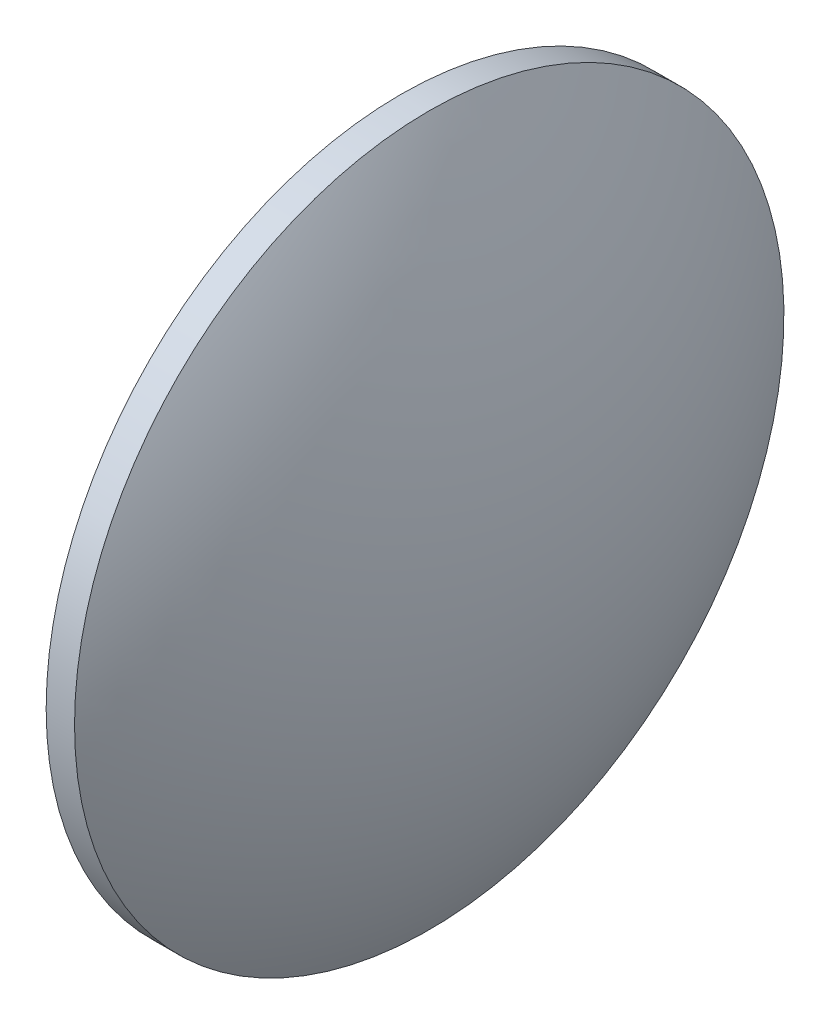
ISO-10303-21;
HEADER;
FILE_DESCRIPTION(('STEP AP214'),'2;1');
FILE_NAME('part.step','',(''),(''),'','','');
FILE_SCHEMA(('AUTOMOTIVE_DESIGN { 1 0 10303 214 1 1 1 1 }'));
ENDSEC;
DATA;
#1=APPLICATION_CONTEXT('core data for automotive mechanical design processes');
#2=APPLICATION_PROTOCOL_DEFINITION('international standard','automotive_design',2000,#1);
#3=PRODUCT_CONTEXT('',#1,'mechanical');
#4=PRODUCT('Part','Part','',(#3));
#5=PRODUCT_RELATED_PRODUCT_CATEGORY('part','',(#4));
#6=PRODUCT_DEFINITION_FORMATION('','',#4);
#7=PRODUCT_DEFINITION_CONTEXT('part definition',#1,'design');
#8=PRODUCT_DEFINITION('design','',#6,#7);
#9=PRODUCT_DEFINITION_SHAPE('','',#8);
#10=(LENGTH_UNIT() NAMED_UNIT(*) SI_UNIT(.MILLI.,.METRE.));
#11=(NAMED_UNIT(*) PLANE_ANGLE_UNIT() SI_UNIT($,.RADIAN.));
#12=(NAMED_UNIT(*) SI_UNIT($,.STERADIAN.) SOLID_ANGLE_UNIT());
#13=UNCERTAINTY_MEASURE_WITH_UNIT(LENGTH_MEASURE(1.E-05),#10,'distance_accuracy_value','');
#14=(GEOMETRIC_REPRESENTATION_CONTEXT(3) GLOBAL_UNCERTAINTY_ASSIGNED_CONTEXT((#13)) GLOBAL_UNIT_ASSIGNED_CONTEXT((#10,
#11,#12)) REPRESENTATION_CONTEXT('',''));
#15=CARTESIAN_POINT('',(0.,0.,0.));
#16=DIRECTION('',(0.,0.,1.));
#17=DIRECTION('',(1.,0.,0.));
#18=AXIS2_PLACEMENT_3D('',#15,#16,#17);
#19=CARTESIAN_POINT('',(422.349612919836,191.402019776316,0.));
#20=DIRECTION('',(-1.,0.,0.));
#21=DIRECTION('',(0.,1.,0.));
#22=AXIS2_PLACEMENT_3D('',#19,#20,#21);
#23=SPHERICAL_SURFACE('',#22,97.7230232558132);
#24=CARTESIAN_POINT('',(338.386589664023,191.402019776316,0.));
#25=DIRECTION('',(-1.,0.,0.));
#26=DIRECTION('',(0.,0.,1.));
#27=AXIS2_PLACEMENT_3D('',#24,#25,#26);
#28=CIRCLE('',#27,49.9999999999995);
#29=CARTESIAN_POINT('',(338.386589664023,191.402019776316,49.9999999999995));
#30=VERTEX_POINT('',#29);
#31=EDGE_CURVE('E46',#30,#30,#28,.T.);
#32=ORIENTED_EDGE('',*,*,#31,.T.);
#33=EDGE_LOOP('',(#32));
#34=FACE_BOUND('',#33,.T.);
#35=ADVANCED_FACE('F39',(#34),#23,.T.);
#36=CARTESIAN_POINT('',(258.42356640821,191.402019776316,0.));
#37=DIRECTION('',(-1.,0.,0.));
#38=DIRECTION('',(0.,1.,0.));
#39=AXIS2_PLACEMENT_3D('',#36,#37,#38);
#40=SPHERICAL_SURFACE('',#39,97.7230232558129);
#41=CARTESIAN_POINT('',(342.386589664023,191.402019776316,0.));
#42=DIRECTION('',(-1.,0.,0.));
#43=DIRECTION('',(0.,0.,1.));
#44=AXIS2_PLACEMENT_3D('',#41,#42,#43);
#45=CIRCLE('',#44,49.9999999999995);
#46=CARTESIAN_POINT('',(342.386589664023,191.402019776316,49.9999999999995));
#47=VERTEX_POINT('',#46);
#48=EDGE_CURVE('E10',#47,#47,#45,.T.);
#49=ORIENTED_EDGE('',*,*,#48,.F.);
#50=EDGE_LOOP('',(#49));
#51=FACE_BOUND('',#50,.T.);
#52=ADVANCED_FACE('F56',(#51),#40,.T.);
#53=CARTESIAN_POINT('',(315.881910424626,191.402019776316,0.));
#54=DIRECTION('',(-1.,0.,0.));
#55=DIRECTION('',(0.,0.,1.));
#56=AXIS2_PLACEMENT_3D('',#53,#54,#55);
#57=CYLINDRICAL_SURFACE('',#56,49.9999999999995);
#58=ORIENTED_EDGE('',*,*,#48,.T.);
#59=EDGE_LOOP('',(#58));
#60=FACE_BOUND('',#59,.T.);
#61=ORIENTED_EDGE('',*,*,#31,.F.);
#62=EDGE_LOOP('',(#61));
#63=FACE_BOUND('',#62,.T.);
#64=ADVANCED_FACE('F54',(#60,#63),#57,.T.);
#65=CLOSED_SHELL('',(#35,#52,#64));
#66=MANIFOLD_SOLID_BREP('B2',#65);
#67=ADVANCED_BREP_SHAPE_REPRESENTATION('',(#18,#66),#14);
#68=SHAPE_DEFINITION_REPRESENTATION(#9,#67);
ENDSEC;
END-ISO-10303-21;
